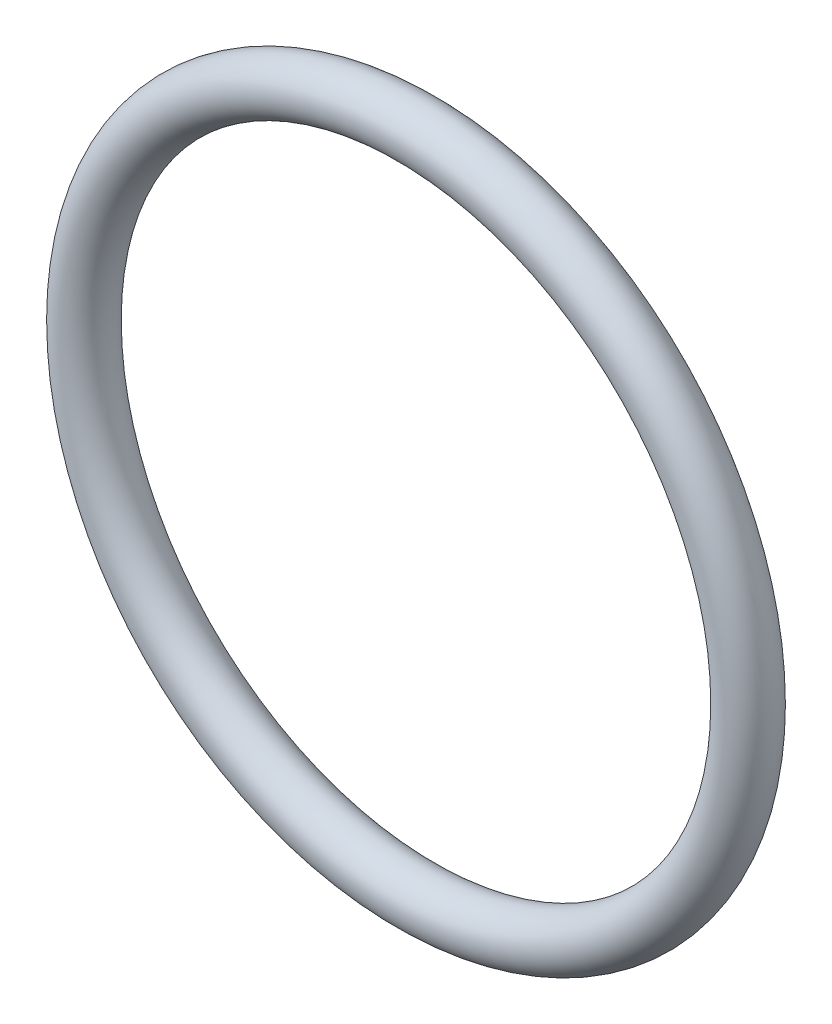
ISO-10303-21;
HEADER;
FILE_DESCRIPTION(('STEP AP214'),'2;1');
FILE_NAME('part.step','',(''),(''),'','','');
FILE_SCHEMA(('AUTOMOTIVE_DESIGN { 1 0 10303 214 1 1 1 1 }'));
ENDSEC;
DATA;
#1=APPLICATION_CONTEXT('core data for automotive mechanical design processes');
#2=APPLICATION_PROTOCOL_DEFINITION('international standard','automotive_design',2000,#1);
#3=PRODUCT_CONTEXT('',#1,'mechanical');
#4=PRODUCT('Part','Part','',(#3));
#5=PRODUCT_RELATED_PRODUCT_CATEGORY('part','',(#4));
#6=PRODUCT_DEFINITION_FORMATION('','',#4);
#7=PRODUCT_DEFINITION_CONTEXT('part definition',#1,'design');
#8=PRODUCT_DEFINITION('design','',#6,#7);
#9=PRODUCT_DEFINITION_SHAPE('','',#8);
#10=(LENGTH_UNIT() NAMED_UNIT(*) SI_UNIT(.MILLI.,.METRE.));
#11=(NAMED_UNIT(*) PLANE_ANGLE_UNIT() SI_UNIT($,.RADIAN.));
#12=(NAMED_UNIT(*) SI_UNIT($,.STERADIAN.) SOLID_ANGLE_UNIT());
#13=UNCERTAINTY_MEASURE_WITH_UNIT(LENGTH_MEASURE(1.E-05),#10,'distance_accuracy_value','');
#14=(GEOMETRIC_REPRESENTATION_CONTEXT(3) GLOBAL_UNCERTAINTY_ASSIGNED_CONTEXT((#13)) GLOBAL_UNIT_ASSIGNED_CONTEXT((#10,
#11,#12)) REPRESENTATION_CONTEXT('',''));
#15=CARTESIAN_POINT('',(0.,0.,0.));
#16=DIRECTION('',(0.,0.,1.));
#17=DIRECTION('',(1.,0.,0.));
#18=AXIS2_PLACEMENT_3D('',#15,#16,#17);
#19=CARTESIAN_POINT('',(0.,0.,0.));
#20=DIRECTION('',(0.,0.,1.));
#21=DIRECTION('',(1.,0.,0.));
#22=AXIS2_PLACEMENT_3D('',#19,#20,#21);
#23=TOROIDAL_SURFACE('',#22,22.1996,1.7653);
#24=CARTESIAN_POINT('',(23.9649,0.,0.));
#25=VERTEX_POINT('',#24);
#26=VERTEX_LOOP('',#25);
#27=FACE_BOUND('',#26,.T.);
#28=ADVANCED_FACE('F30',(#27),#23,.T.);
#29=CLOSED_SHELL('',(#28));
#30=MANIFOLD_SOLID_BREP('B2',#29);
#31=ADVANCED_BREP_SHAPE_REPRESENTATION('',(#18,#30),#14);
#32=SHAPE_DEFINITION_REPRESENTATION(#9,#31);
ENDSEC;
END-ISO-10303-21;
